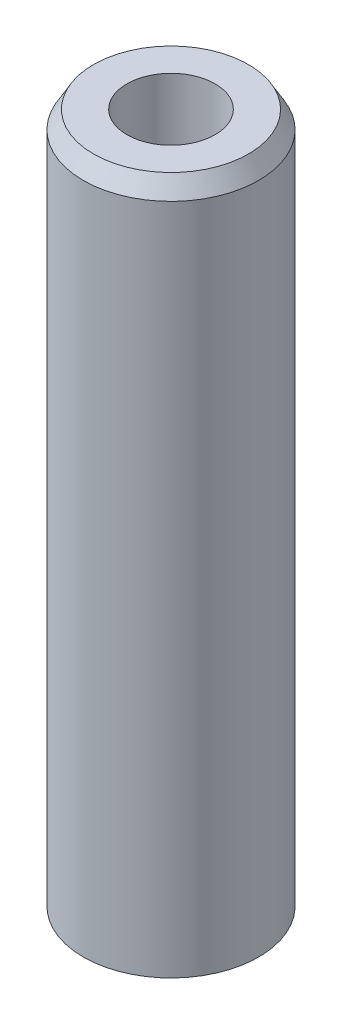
ISO-10303-21;
HEADER;
FILE_DESCRIPTION(('STEP AP214'),'2;1');
FILE_NAME('part.step','',(''),(''),'','','');
FILE_SCHEMA(('AUTOMOTIVE_DESIGN { 1 0 10303 214 1 1 1 1 }'));
ENDSEC;
DATA;
#1=APPLICATION_CONTEXT('core data for automotive mechanical design processes');
#2=APPLICATION_PROTOCOL_DEFINITION('international standard','automotive_design',2000,#1);
#3=PRODUCT_CONTEXT('',#1,'mechanical');
#4=PRODUCT('Part','Part','',(#3));
#5=PRODUCT_RELATED_PRODUCT_CATEGORY('part','',(#4));
#6=PRODUCT_DEFINITION_FORMATION('','',#4);
#7=PRODUCT_DEFINITION_CONTEXT('part definition',#1,'design');
#8=PRODUCT_DEFINITION('design','',#6,#7);
#9=PRODUCT_DEFINITION_SHAPE('','',#8);
#10=(LENGTH_UNIT() NAMED_UNIT(*) SI_UNIT(.MILLI.,.METRE.));
#11=(NAMED_UNIT(*) PLANE_ANGLE_UNIT() SI_UNIT($,.RADIAN.));
#12=(NAMED_UNIT(*) SI_UNIT($,.STERADIAN.) SOLID_ANGLE_UNIT());
#13=UNCERTAINTY_MEASURE_WITH_UNIT(LENGTH_MEASURE(1.E-05),#10,'distance_accuracy_value','');
#14=(GEOMETRIC_REPRESENTATION_CONTEXT(3) GLOBAL_UNCERTAINTY_ASSIGNED_CONTEXT((#13)) GLOBAL_UNIT_ASSIGNED_CONTEXT((#10,
#11,#12)) REPRESENTATION_CONTEXT('',''));
#15=CARTESIAN_POINT('',(0.,0.,0.));
#16=DIRECTION('',(0.,0.,1.));
#17=DIRECTION('',(1.,0.,0.));
#18=AXIS2_PLACEMENT_3D('',#15,#16,#17);
#19=CARTESIAN_POINT('',(0.,59.8809689189818,0.));
#20=DIRECTION('',(0.,-1.,0.));
#21=DIRECTION('',(0.,0.,-1.));
#22=AXIS2_PLACEMENT_3D('',#19,#20,#21);
#23=CYLINDRICAL_SURFACE('',#22,7.5);
#24=CARTESIAN_POINT('',(0.,58.3635124922424,0.));
#25=DIRECTION('',(0.,1.,0.));
#26=DIRECTION('',(0.,0.,1.));
#27=AXIS2_PLACEMENT_3D('',#24,#25,#26);
#28=CIRCLE('',#27,7.5);
#29=CARTESIAN_POINT('',(0.,58.3635124922424,7.5));
#30=VERTEX_POINT('',#29);
#31=EDGE_CURVE('E50',#30,#30,#28,.F.);
#32=ORIENTED_EDGE('',*,*,#31,.T.);
#33=EDGE_LOOP('',(#32));
#34=FACE_BOUND('',#33,.T.);
#35=CARTESIAN_POINT('',(0.,0.876103876461497,0.));
#36=DIRECTION('',(0.,1.,0.));
#37=DIRECTION('',(0.,0.,1.));
#38=AXIS2_PLACEMENT_3D('',#35,#36,#37);
#39=CIRCLE('',#38,7.5);
#40=CARTESIAN_POINT('',(0.,0.876103876461497,7.5));
#41=VERTEX_POINT('',#40);
#42=EDGE_CURVE('E51',#41,#41,#39,.T.);
#43=ORIENTED_EDGE('',*,*,#42,.T.);
#44=EDGE_LOOP('',(#43));
#45=FACE_BOUND('',#44,.T.);
#46=ADVANCED_FACE('F39',(#34,#45),#23,.T.);
#47=CARTESIAN_POINT('',(0.,59.8809689189818,0.));
#48=DIRECTION('',(0.,1.,0.));
#49=DIRECTION('',(0.,0.,1.));
#50=AXIS2_PLACEMENT_3D('',#47,#48,#49);
#51=PLANE('',#50);
#52=CARTESIAN_POINT('',(0.,59.8809689189818,0.));
#53=DIRECTION('',(0.,1.,0.));
#54=DIRECTION('',(0.,0.,1.));
#55=AXIS2_PLACEMENT_3D('',#52,#53,#54);
#56=CIRCLE('',#55,6.62389612353848);
#57=CARTESIAN_POINT('',(0.,59.8809689189818,6.62389612353848));
#58=VERTEX_POINT('',#57);
#59=EDGE_CURVE('E54',#58,#58,#56,.T.);
#60=ORIENTED_EDGE('',*,*,#59,.T.);
#61=EDGE_LOOP('',(#60));
#62=FACE_BOUND('',#61,.T.);
#63=CARTESIAN_POINT('',(0.,59.8809689189818,0.));
#64=DIRECTION('',(0.,1.,0.));
#65=DIRECTION('',(0.,0.,1.));
#66=AXIS2_PLACEMENT_3D('',#63,#64,#65);
#67=CIRCLE('',#66,3.76996331016778);
#68=CARTESIAN_POINT('',(0.,59.8809689189818,3.76996331016778));
#69=VERTEX_POINT('',#68);
#70=EDGE_CURVE('E58',#69,#69,#67,.T.);
#71=ORIENTED_EDGE('',*,*,#70,.F.);
#72=EDGE_LOOP('',(#71));
#73=FACE_BOUND('',#72,.T.);
#74=ADVANCED_FACE('F69',(#62,#73),#51,.T.);
#75=CARTESIAN_POINT('',(0.,0.,0.));
#76=DIRECTION('',(0.,1.,0.));
#77=DIRECTION('',(0.,0.,1.));
#78=AXIS2_PLACEMENT_3D('',#75,#76,#77);
#79=PLANE('',#78);
#80=CARTESIAN_POINT('',(0.,0.,0.));
#81=DIRECTION('',(0.,1.,0.));
#82=DIRECTION('',(0.,0.,1.));
#83=AXIS2_PLACEMENT_3D('',#80,#81,#82);
#84=CIRCLE('',#83,5.98254357326063);
#85=CARTESIAN_POINT('',(0.,0.,5.98254357326063));
#86=VERTEX_POINT('',#85);
#87=EDGE_CURVE('E10',#86,#86,#84,.F.);
#88=ORIENTED_EDGE('',*,*,#87,.T.);
#89=EDGE_LOOP('',(#88));
#90=FACE_BOUND('',#89,.T.);
#91=CARTESIAN_POINT('',(0.,0.,0.));
#92=DIRECTION('',(0.,1.,0.));
#93=DIRECTION('',(0.,0.,1.));
#94=AXIS2_PLACEMENT_3D('',#91,#92,#93);
#95=CIRCLE('',#94,3.76996331016778);
#96=CARTESIAN_POINT('',(0.,0.,3.76996331016778));
#97=VERTEX_POINT('',#96);
#98=EDGE_CURVE('E63',#97,#97,#95,.T.);
#99=ORIENTED_EDGE('',*,*,#98,.T.);
#100=EDGE_LOOP('',(#99));
#101=FACE_BOUND('',#100,.T.);
#102=ADVANCED_FACE('F75',(#90,#101),#79,.F.);
#103=CARTESIAN_POINT('',(0.,59.8809689189818,0.));
#104=DIRECTION('',(0.,-1.,0.));
#105=DIRECTION('',(0.,0.,-1.));
#106=AXIS2_PLACEMENT_3D('',#103,#104,#105);
#107=CYLINDRICAL_SURFACE('',#106,3.76996331016778);
#108=ORIENTED_EDGE('',*,*,#70,.T.);
#109=EDGE_LOOP('',(#108));
#110=FACE_BOUND('',#109,.T.);
#111=ORIENTED_EDGE('',*,*,#98,.F.);
#112=EDGE_LOOP('',(#111));
#113=FACE_BOUND('',#112,.T.);
#114=ADVANCED_FACE('F70',(#110,#113),#107,.F.);
#115=CARTESIAN_POINT('',(0.,59.8809689189818,0.));
#116=DIRECTION('',(0.,-1.,0.));
#117=DIRECTION('',(0.,0.,-1.));
#118=AXIS2_PLACEMENT_3D('',#115,#116,#117);
#119=CONICAL_SURFACE('',#118,6.62389612353848,0.523598775598295);
#120=ORIENTED_EDGE('',*,*,#31,.F.);
#121=EDGE_LOOP('',(#120));
#122=FACE_BOUND('',#121,.T.);
#123=ORIENTED_EDGE('',*,*,#59,.F.);
#124=EDGE_LOOP('',(#123));
#125=FACE_BOUND('',#124,.T.);
#126=ADVANCED_FACE('F81',(#122,#125),#119,.T.);
#127=CARTESIAN_POINT('',(0.,0.876103876461497,0.));
#128=DIRECTION('',(0.,1.,0.));
#129=DIRECTION('',(0.,0.,1.));
#130=AXIS2_PLACEMENT_3D('',#127,#128,#129);
#131=CONICAL_SURFACE('',#130,7.5,1.0471975511966);
#132=ORIENTED_EDGE('',*,*,#87,.F.);
#133=EDGE_LOOP('',(#132));
#134=FACE_BOUND('',#133,.T.);
#135=ORIENTED_EDGE('',*,*,#42,.F.);
#136=EDGE_LOOP('',(#135));
#137=FACE_BOUND('',#136,.T.);
#138=ADVANCED_FACE('F45',(#134,#137),#131,.T.);
#139=CLOSED_SHELL('',(#46,#74,#102,#114,#126,#138));
#140=MANIFOLD_SOLID_BREP('B2',#139);
#141=ADVANCED_BREP_SHAPE_REPRESENTATION('',(#18,#140),#14);
#142=SHAPE_DEFINITION_REPRESENTATION(#9,#141);
ENDSEC;
END-ISO-10303-21;
